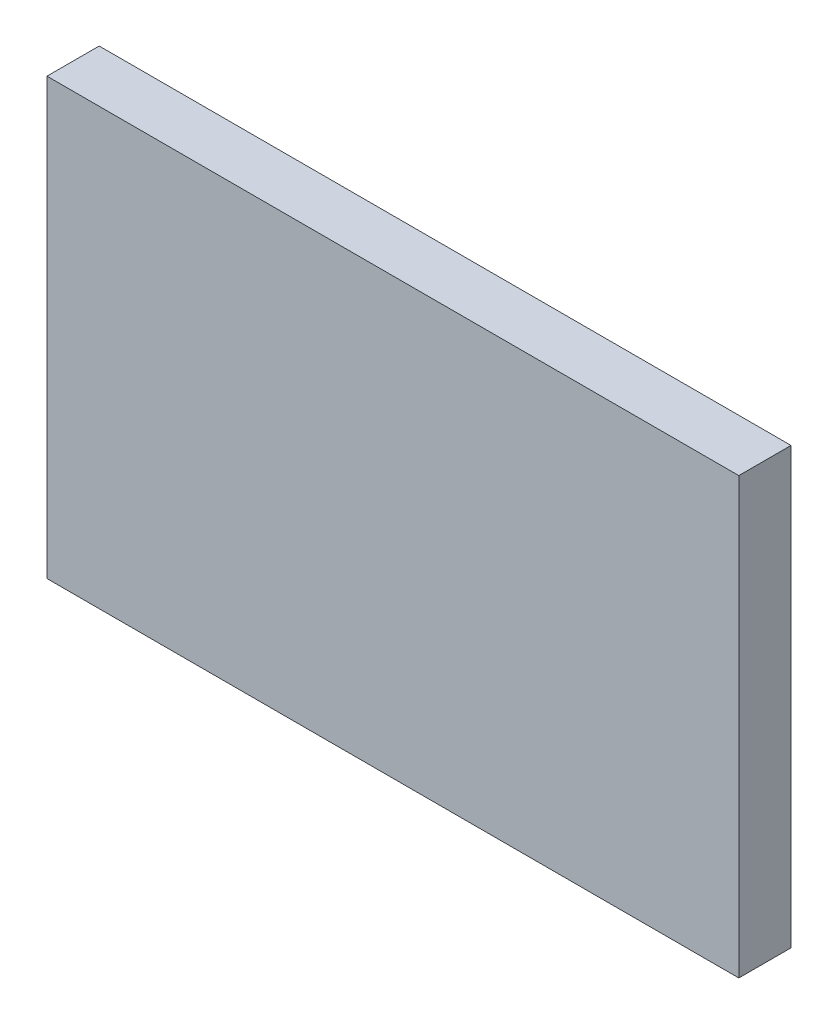
ISO-10303-21;
HEADER;
FILE_DESCRIPTION(('STEP AP214'),'2;1');
FILE_NAME('part.step','',(''),(''),'','','');
FILE_SCHEMA(('AUTOMOTIVE_DESIGN { 1 0 10303 214 1 1 1 1 }'));
ENDSEC;
DATA;
#1=APPLICATION_CONTEXT('core data for automotive mechanical design processes');
#2=APPLICATION_PROTOCOL_DEFINITION('international standard','automotive_design',2000,#1);
#3=PRODUCT_CONTEXT('',#1,'mechanical');
#4=PRODUCT('Part','Part','',(#3));
#5=PRODUCT_RELATED_PRODUCT_CATEGORY('part','',(#4));
#6=PRODUCT_DEFINITION_FORMATION('','',#4);
#7=PRODUCT_DEFINITION_CONTEXT('part definition',#1,'design');
#8=PRODUCT_DEFINITION('design','',#6,#7);
#9=PRODUCT_DEFINITION_SHAPE('','',#8);
#10=(LENGTH_UNIT() NAMED_UNIT(*) SI_UNIT(.MILLI.,.METRE.));
#11=(NAMED_UNIT(*) PLANE_ANGLE_UNIT() SI_UNIT($,.RADIAN.));
#12=(NAMED_UNIT(*) SI_UNIT($,.STERADIAN.) SOLID_ANGLE_UNIT());
#13=UNCERTAINTY_MEASURE_WITH_UNIT(LENGTH_MEASURE(1.E-05),#10,'distance_accuracy_value','');
#14=(GEOMETRIC_REPRESENTATION_CONTEXT(3) GLOBAL_UNCERTAINTY_ASSIGNED_CONTEXT((#13)) GLOBAL_UNIT_ASSIGNED_CONTEXT((#10,
#11,#12)) REPRESENTATION_CONTEXT('',''));
#15=CARTESIAN_POINT('',(0.,0.,0.));
#16=DIRECTION('',(0.,0.,1.));
#17=DIRECTION('',(1.,0.,0.));
#18=AXIS2_PLACEMENT_3D('',#15,#16,#17);
#19=CARTESIAN_POINT('',(159.,0.,12.));
#20=DIRECTION('',(0.,1.,0.));
#21=DIRECTION('',(-1.,0.,0.));
#22=AXIS2_PLACEMENT_3D('',#19,#20,#21);
#23=PLANE('',#22);
#24=DIRECTION('',(1.,0.,0.));
#25=VECTOR('',#24,1.);
#26=CARTESIAN_POINT('',(159.,0.,0.));
#27=LINE('',#26,#25);
#28=CARTESIAN_POINT('',(0.,0.,0.));
#29=VERTEX_POINT('',#28);
#30=CARTESIAN_POINT('',(159.,0.,0.));
#31=VERTEX_POINT('',#30);
#32=EDGE_CURVE('E99',#29,#31,#27,.T.);
#33=ORIENTED_EDGE('',*,*,#32,.T.);
#34=DIRECTION('',(0.,0.,-1.));
#35=VECTOR('',#34,1.);
#36=CARTESIAN_POINT('',(159.,0.,12.));
#37=LINE('',#36,#35);
#38=CARTESIAN_POINT('',(159.,0.,12.));
#39=VERTEX_POINT('',#38);
#40=EDGE_CURVE('E11',#39,#31,#37,.T.);
#41=ORIENTED_EDGE('',*,*,#40,.F.);
#42=DIRECTION('',(1.,0.,0.));
#43=VECTOR('',#42,1.);
#44=CARTESIAN_POINT('',(159.,0.,12.));
#45=LINE('',#44,#43);
#46=CARTESIAN_POINT('',(0.,0.,12.));
#47=VERTEX_POINT('',#46);
#48=EDGE_CURVE('E87',#47,#39,#45,.T.);
#49=ORIENTED_EDGE('',*,*,#48,.F.);
#50=DIRECTION('',(0.,0.,-1.));
#51=VECTOR('',#50,1.);
#52=CARTESIAN_POINT('',(0.,0.,12.));
#53=LINE('',#52,#51);
#54=EDGE_CURVE('E95',#47,#29,#53,.T.);
#55=ORIENTED_EDGE('',*,*,#54,.T.);
#56=EDGE_LOOP('',(#33,#41,#49,#55));
#57=FACE_BOUND('',#56,.T.);
#58=ADVANCED_FACE('F36',(#57),#23,.F.);
#59=CARTESIAN_POINT('',(159.,100.,12.));
#60=DIRECTION('',(-1.,0.,0.));
#61=DIRECTION('',(0.,0.,1.));
#62=AXIS2_PLACEMENT_3D('',#59,#60,#61);
#63=PLANE('',#62);
#64=DIRECTION('',(0.,1.,0.));
#65=VECTOR('',#64,1.);
#66=CARTESIAN_POINT('',(159.,100.,0.));
#67=LINE('',#66,#65);
#68=CARTESIAN_POINT('',(159.,100.,0.));
#69=VERTEX_POINT('',#68);
#70=EDGE_CURVE('E91',#31,#69,#67,.T.);
#71=ORIENTED_EDGE('',*,*,#70,.T.);
#72=DIRECTION('',(0.,0.,-1.));
#73=VECTOR('',#72,1.);
#74=CARTESIAN_POINT('',(159.,100.,12.));
#75=LINE('',#74,#73);
#76=CARTESIAN_POINT('',(159.,100.,12.));
#77=VERTEX_POINT('',#76);
#78=EDGE_CURVE('E44',#77,#69,#75,.T.);
#79=ORIENTED_EDGE('',*,*,#78,.F.);
#80=DIRECTION('',(0.,1.,0.));
#81=VECTOR('',#80,1.);
#82=CARTESIAN_POINT('',(159.,100.,12.));
#83=LINE('',#82,#81);
#84=EDGE_CURVE('E82',#39,#77,#83,.T.);
#85=ORIENTED_EDGE('',*,*,#84,.F.);
#86=ORIENTED_EDGE('',*,*,#40,.T.);
#87=EDGE_LOOP('',(#71,#79,#85,#86));
#88=FACE_BOUND('',#87,.T.);
#89=ADVANCED_FACE('F90',(#88),#63,.F.);
#90=CARTESIAN_POINT('',(0.,100.,12.));
#91=DIRECTION('',(0.,-1.,0.));
#92=DIRECTION('',(0.,0.,-1.));
#93=AXIS2_PLACEMENT_3D('',#90,#91,#92);
#94=PLANE('',#93);
#95=DIRECTION('',(-1.,0.,0.));
#96=VECTOR('',#95,1.);
#97=CARTESIAN_POINT('',(0.,100.,0.));
#98=LINE('',#97,#96);
#99=CARTESIAN_POINT('',(0.,100.,0.));
#100=VERTEX_POINT('',#99);
#101=EDGE_CURVE('E69',#69,#100,#98,.T.);
#102=ORIENTED_EDGE('',*,*,#101,.T.);
#103=DIRECTION('',(0.,0.,-1.));
#104=VECTOR('',#103,1.);
#105=CARTESIAN_POINT('',(0.,100.,12.));
#106=LINE('',#105,#104);
#107=CARTESIAN_POINT('',(0.,100.,12.));
#108=VERTEX_POINT('',#107);
#109=EDGE_CURVE('E92',#108,#100,#106,.T.);
#110=ORIENTED_EDGE('',*,*,#109,.F.);
#111=DIRECTION('',(-1.,0.,0.));
#112=VECTOR('',#111,1.);
#113=CARTESIAN_POINT('',(0.,100.,12.));
#114=LINE('',#113,#112);
#115=EDGE_CURVE('E85',#77,#108,#114,.T.);
#116=ORIENTED_EDGE('',*,*,#115,.F.);
#117=ORIENTED_EDGE('',*,*,#78,.T.);
#118=EDGE_LOOP('',(#102,#110,#116,#117));
#119=FACE_BOUND('',#118,.T.);
#120=ADVANCED_FACE('F93',(#119),#94,.F.);
#121=CARTESIAN_POINT('',(0.,0.,12.));
#122=DIRECTION('',(1.,0.,0.));
#123=DIRECTION('',(0.,0.,-1.));
#124=AXIS2_PLACEMENT_3D('',#121,#122,#123);
#125=PLANE('',#124);
#126=DIRECTION('',(0.,-1.,0.));
#127=VECTOR('',#126,1.);
#128=CARTESIAN_POINT('',(0.,0.,0.));
#129=LINE('',#128,#127);
#130=EDGE_CURVE('E75',#100,#29,#129,.T.);
#131=ORIENTED_EDGE('',*,*,#130,.T.);
#132=ORIENTED_EDGE('',*,*,#54,.F.);
#133=DIRECTION('',(0.,-1.,0.));
#134=VECTOR('',#133,1.);
#135=CARTESIAN_POINT('',(0.,0.,12.));
#136=LINE('',#135,#134);
#137=EDGE_CURVE('E52',#108,#47,#136,.T.);
#138=ORIENTED_EDGE('',*,*,#137,.F.);
#139=ORIENTED_EDGE('',*,*,#109,.T.);
#140=EDGE_LOOP('',(#131,#132,#138,#139));
#141=FACE_BOUND('',#140,.T.);
#142=ADVANCED_FACE('F106',(#141),#125,.F.);
#143=CARTESIAN_POINT('',(0.,0.,12.));
#144=DIRECTION('',(0.,0.,-1.));
#145=DIRECTION('',(-1.,0.,0.));
#146=AXIS2_PLACEMENT_3D('',#143,#144,#145);
#147=PLANE('',#146);
#148=ORIENTED_EDGE('',*,*,#48,.T.);
#149=ORIENTED_EDGE('',*,*,#84,.T.);
#150=ORIENTED_EDGE('',*,*,#115,.T.);
#151=ORIENTED_EDGE('',*,*,#137,.T.);
#152=EDGE_LOOP('',(#148,#149,#150,#151));
#153=FACE_BOUND('',#152,.T.);
#154=ADVANCED_FACE('F83',(#153),#147,.F.);
#155=CARTESIAN_POINT('',(0.,0.,0.));
#156=DIRECTION('',(0.,0.,-1.));
#157=DIRECTION('',(-1.,0.,0.));
#158=AXIS2_PLACEMENT_3D('',#155,#156,#157);
#159=PLANE('',#158);
#160=ORIENTED_EDGE('',*,*,#32,.F.);
#161=ORIENTED_EDGE('',*,*,#130,.F.);
#162=ORIENTED_EDGE('',*,*,#101,.F.);
#163=ORIENTED_EDGE('',*,*,#70,.F.);
#164=EDGE_LOOP('',(#160,#161,#162,#163));
#165=FACE_BOUND('',#164,.T.);
#166=ADVANCED_FACE('F109',(#165),#159,.T.);
#167=CLOSED_SHELL('',(#58,#89,#120,#142,#154,#166));
#168=MANIFOLD_SOLID_BREP('B2',#167);
#169=ADVANCED_BREP_SHAPE_REPRESENTATION('',(#18,#168),#14);
#170=SHAPE_DEFINITION_REPRESENTATION(#9,#169);
ENDSEC;
END-ISO-10303-21;
